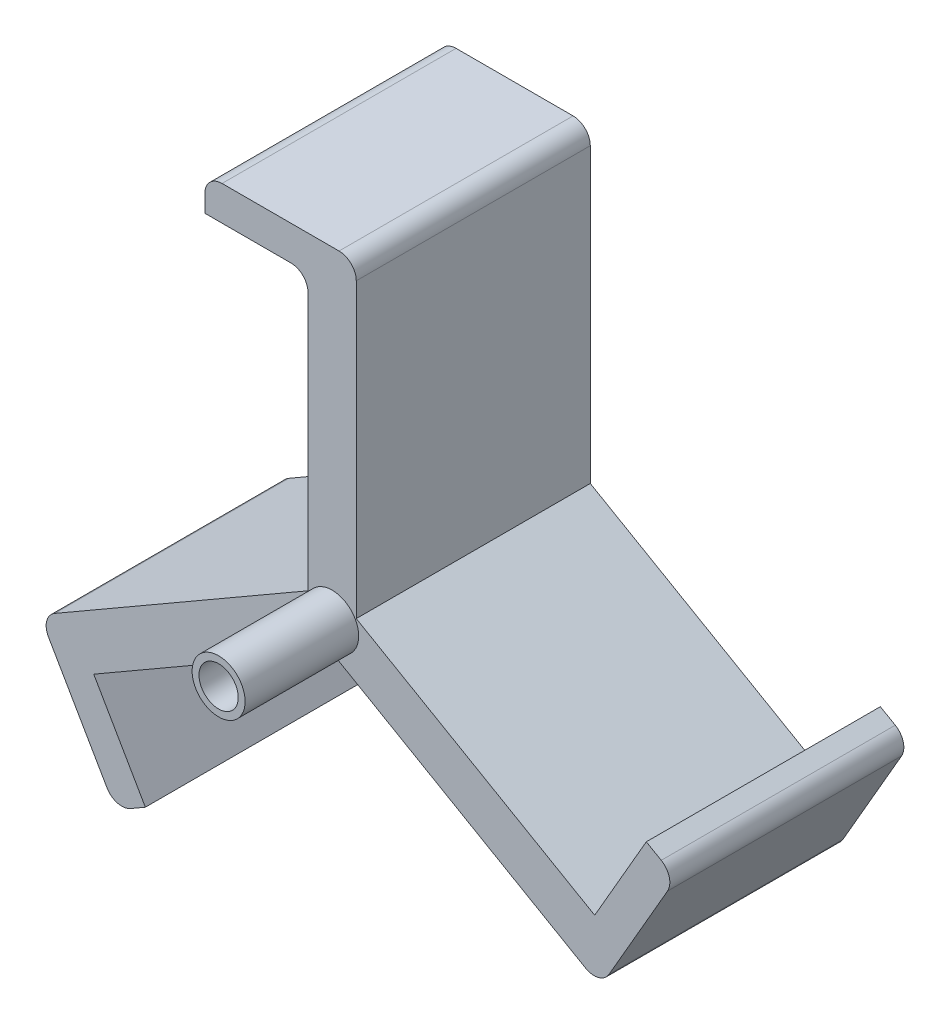
ISO-10303-21;
HEADER;
FILE_DESCRIPTION(('STEP AP214'),'2;1');
FILE_NAME('part.step','',(''),(''),'','','');
FILE_SCHEMA(('AUTOMOTIVE_DESIGN { 1 0 10303 214 1 1 1 1 }'));
ENDSEC;
DATA;
#1=APPLICATION_CONTEXT('core data for automotive mechanical design processes');
#2=APPLICATION_PROTOCOL_DEFINITION('international standard','automotive_design',2000,#1);
#3=PRODUCT_CONTEXT('',#1,'mechanical');
#4=PRODUCT('Part','Part','',(#3));
#5=PRODUCT_RELATED_PRODUCT_CATEGORY('part','',(#4));
#6=PRODUCT_DEFINITION_FORMATION('','',#4);
#7=PRODUCT_DEFINITION_CONTEXT('part definition',#1,'design');
#8=PRODUCT_DEFINITION('design','',#6,#7);
#9=PRODUCT_DEFINITION_SHAPE('','',#8);
#10=(LENGTH_UNIT() NAMED_UNIT(*) SI_UNIT(.MILLI.,.METRE.));
#11=(NAMED_UNIT(*) PLANE_ANGLE_UNIT() SI_UNIT($,.RADIAN.));
#12=(NAMED_UNIT(*) SI_UNIT($,.STERADIAN.) SOLID_ANGLE_UNIT());
#13=UNCERTAINTY_MEASURE_WITH_UNIT(LENGTH_MEASURE(1.E-05),#10,'distance_accuracy_value','');
#14=(GEOMETRIC_REPRESENTATION_CONTEXT(3) GLOBAL_UNCERTAINTY_ASSIGNED_CONTEXT((#13)) GLOBAL_UNIT_ASSIGNED_CONTEXT((#10,
#11,#12)) REPRESENTATION_CONTEXT('',''));
#15=CARTESIAN_POINT('',(0.,0.,0.));
#16=DIRECTION('',(0.,0.,1.));
#17=DIRECTION('',(1.,0.,0.));
#18=AXIS2_PLACEMENT_3D('',#15,#16,#17);
#19=CARTESIAN_POINT('',(0.591220249950698,-5.44190105340275,34.));
#20=DIRECTION('',(-0.499999999999986,-0.866025403784447,0.));
#21=DIRECTION('',(0.866025403784447,-0.499999999999986,0.));
#22=AXIS2_PLACEMENT_3D('',#19,#20,#21);
#23=PLANE('',#22);
#24=DIRECTION('',(0.,0.,1.));
#25=VECTOR('',#24,1.);
#26=CARTESIAN_POINT('',(35.2322364013286,-25.4419010534022,34.));
#27=LINE('',#26,#25);
#28=CARTESIAN_POINT('',(35.2322364013286,-25.4419010534022,0.));
#29=VERTEX_POINT('',#28);
#30=CARTESIAN_POINT('',(35.2322364013286,-25.4419010534022,34.));
#31=VERTEX_POINT('',#30);
#32=EDGE_CURVE('E204',#29,#31,#27,.T.);
#33=ORIENTED_EDGE('',*,*,#32,.F.);
#34=DIRECTION('',(-0.866025403784446,0.499999999999986,0.));
#35=VECTOR('',#34,1.);
#36=CARTESIAN_POINT('',(0.591220249950698,-5.44190105340275,0.));
#37=LINE('',#36,#35);
#38=CARTESIAN_POINT('',(0.591220249950698,-5.44190105340275,0.));
#39=VERTEX_POINT('',#38);
#40=EDGE_CURVE('E210',#29,#39,#37,.T.);
#41=ORIENTED_EDGE('',*,*,#40,.T.);
#42=DIRECTION('',(0.,0.,-1.));
#43=VECTOR('',#42,1.);
#44=CARTESIAN_POINT('',(0.591220249950698,-5.44190105340275,34.));
#45=LINE('',#44,#43);
#46=CARTESIAN_POINT('',(0.591220249950698,-5.44190105340275,34.));
#47=VERTEX_POINT('',#46);
#48=EDGE_CURVE('E325',#47,#39,#45,.T.);
#49=ORIENTED_EDGE('',*,*,#48,.F.);
#50=DIRECTION('',(-0.866025403784446,0.499999999999986,0.));
#51=VECTOR('',#50,1.);
#52=CARTESIAN_POINT('',(0.591220249950698,-5.44190105340275,34.));
#53=LINE('',#52,#51);
#54=EDGE_CURVE('E322',#31,#47,#53,.T.);
#55=ORIENTED_EDGE('',*,*,#54,.F.);
#56=EDGE_LOOP('',(#33,#41,#49,#55));
#57=FACE_BOUND('',#56,.T.);
#58=ADVANCED_FACE('F39',(#57),#23,.F.);
#59=CARTESIAN_POINT('',(-2.90877975004921,-11.5040788798939,34.));
#60=DIRECTION('',(-0.499999999999989,0.866025403784445,0.));
#61=DIRECTION('',(-0.866025403784445,-0.499999999999989,0.));
#62=AXIS2_PLACEMENT_3D('',#59,#60,#61);
#63=PLANE('',#62);
#64=DIRECTION('',(0.,0.,1.));
#65=VECTOR('',#64,1.);
#66=CARTESIAN_POINT('',(-37.549795901427,-31.5040788798934,0.));
#67=LINE('',#66,#65);
#68=CARTESIAN_POINT('',(-37.549795901427,-31.5040788798934,0.));
#69=VERTEX_POINT('',#68);
#70=CARTESIAN_POINT('',(-37.549795901427,-31.5040788798934,34.));
#71=VERTEX_POINT('',#70);
#72=EDGE_CURVE('E215',#69,#71,#67,.T.);
#73=ORIENTED_EDGE('',*,*,#72,.F.);
#74=DIRECTION('',(0.866025403784445,0.499999999999989,0.));
#75=VECTOR('',#74,1.);
#76=CARTESIAN_POINT('',(-2.90877975004921,-11.5040788798939,0.));
#77=LINE('',#76,#75);
#78=CARTESIAN_POINT('',(-2.90877975004921,-11.5040788798939,0.));
#79=VERTEX_POINT('',#78);
#80=EDGE_CURVE('E343',#69,#79,#77,.T.);
#81=ORIENTED_EDGE('',*,*,#80,.T.);
#82=DIRECTION('',(0.,0.,-1.));
#83=VECTOR('',#82,1.);
#84=CARTESIAN_POINT('',(-2.90877975004921,-11.5040788798939,34.));
#85=LINE('',#84,#83);
#86=CARTESIAN_POINT('',(-2.90877975004921,-11.5040788798939,34.));
#87=VERTEX_POINT('',#86);
#88=EDGE_CURVE('E358',#87,#79,#85,.T.);
#89=ORIENTED_EDGE('',*,*,#88,.F.);
#90=DIRECTION('',(0.866025403784445,0.499999999999989,0.));
#91=VECTOR('',#90,1.);
#92=CARTESIAN_POINT('',(-2.90877975004921,-11.5040788798939,34.));
#93=LINE('',#92,#91);
#94=EDGE_CURVE('E312',#71,#87,#93,.T.);
#95=ORIENTED_EDGE('',*,*,#94,.F.);
#96=EDGE_LOOP('',(#73,#81,#89,#95));
#97=FACE_BOUND('',#96,.T.);
#98=ADVANCED_FACE('F485',(#97),#63,.F.);
#99=CARTESIAN_POINT('',(-6.40877975004914,-5.44190105340275,34.));
#100=DIRECTION('',(1.,0.,0.));
#101=DIRECTION('',(0.,1.,0.));
#102=AXIS2_PLACEMENT_3D('',#99,#100,#101);
#103=PLANE('',#102);
#104=DIRECTION('',(0.,-1.,0.));
#105=VECTOR('',#104,1.);
#106=CARTESIAN_POINT('',(-6.40877975004914,-5.44190105340275,34.));
#107=LINE('',#106,#105);
#108=CARTESIAN_POINT('',(-6.40877975004914,32.0580989465972,34.));
#109=VERTEX_POINT('',#108);
#110=CARTESIAN_POINT('',(-6.40877975004914,-5.44190105340275,34.));
#111=VERTEX_POINT('',#110);
#112=EDGE_CURVE('E302',#109,#111,#107,.T.);
#113=ORIENTED_EDGE('',*,*,#112,.F.);
#114=DIRECTION('',(0.,0.,1.));
#115=VECTOR('',#114,1.);
#116=CARTESIAN_POINT('',(-6.40877975004914,32.0580989465972,0.));
#117=LINE('',#116,#115);
#118=CARTESIAN_POINT('',(-6.40877975004914,32.0580989465972,0.));
#119=VERTEX_POINT('',#118);
#120=EDGE_CURVE('E405',#109,#119,#117,.F.);
#121=ORIENTED_EDGE('',*,*,#120,.T.);
#122=DIRECTION('',(0.,-1.,0.));
#123=VECTOR('',#122,1.);
#124=CARTESIAN_POINT('',(-6.40877975004914,-5.44190105340275,0.));
#125=LINE('',#124,#123);
#126=CARTESIAN_POINT('',(-6.40877975004914,-5.44190105340275,0.));
#127=VERTEX_POINT('',#126);
#128=EDGE_CURVE('E332',#119,#127,#125,.T.);
#129=ORIENTED_EDGE('',*,*,#128,.T.);
#130=DIRECTION('',(0.,0.,-1.));
#131=VECTOR('',#130,1.);
#132=CARTESIAN_POINT('',(-6.40877975004914,-5.44190105340275,34.));
#133=LINE('',#132,#131);
#134=EDGE_CURVE('E362',#111,#127,#133,.T.);
#135=ORIENTED_EDGE('',*,*,#134,.F.);
#136=EDGE_LOOP('',(#113,#121,#129,#135));
#137=FACE_BOUND('',#136,.T.);
#138=ADVANCED_FACE('F532',(#137),#103,.F.);
#139=CARTESIAN_POINT('',(-2.90877975004922,-7.46262699556651,0.));
#140=DIRECTION('',(0.,0.,1.));
#141=DIRECTION('',(1.,0.,0.));
#142=AXIS2_PLACEMENT_3D('',#139,#140,#141);
#143=CYLINDRICAL_SURFACE('',#142,1.85);
#144=CARTESIAN_POINT('',(-2.90877975004922,-7.46262699556651,34.));
#145=DIRECTION('',(0.,0.,1.));
#146=DIRECTION('',(1.,0.,0.));
#147=AXIS2_PLACEMENT_3D('',#144,#145,#146);
#148=CIRCLE('',#147,1.85);
#149=CARTESIAN_POINT('',(-1.05877975004922,-7.46262699556651,34.));
#150=VERTEX_POINT('',#149);
#151=EDGE_CURVE('E278',#150,#150,#148,.T.);
#152=ORIENTED_EDGE('',*,*,#151,.T.);
#153=EDGE_LOOP('',(#152));
#154=FACE_BOUND('',#153,.T.);
#155=CARTESIAN_POINT('',(-2.90877975004922,-7.46262699556651,4.));
#156=DIRECTION('',(0.,0.,-1.));
#157=DIRECTION('',(-1.,0.,0.));
#158=AXIS2_PLACEMENT_3D('',#155,#156,#157);
#159=CIRCLE('',#158,1.85);
#160=CARTESIAN_POINT('',(-4.75877975004922,-7.46262699556651,4.));
#161=VERTEX_POINT('',#160);
#162=EDGE_CURVE('E274',#161,#161,#159,.F.);
#163=ORIENTED_EDGE('',*,*,#162,.F.);
#164=EDGE_LOOP('',(#163));
#165=FACE_BOUND('',#164,.T.);
#166=ADVANCED_FACE('F564',(#154,#165),#143,.F.);
#167=CARTESIAN_POINT('',(0.591220249950855,39.5580989465973,34.));
#168=DIRECTION('',(-1.,0.,0.));
#169=DIRECTION('',(0.,-1.,0.));
#170=AXIS2_PLACEMENT_3D('',#167,#168,#169);
#171=PLANE('',#170);
#172=DIRECTION('',(0.,1.,0.));
#173=VECTOR('',#172,1.);
#174=CARTESIAN_POINT('',(0.591220249950855,39.5580989465973,0.));
#175=LINE('',#174,#173);
#176=CARTESIAN_POINT('',(0.591220249950846,37.0580989465972,0.));
#177=VERTEX_POINT('',#176);
#178=EDGE_CURVE('E291',#39,#177,#175,.T.);
#179=ORIENTED_EDGE('',*,*,#178,.T.);
#180=DIRECTION('',(0.,0.,-1.));
#181=VECTOR('',#180,1.);
#182=CARTESIAN_POINT('',(0.591220249950846,37.0580989465972,34.));
#183=LINE('',#182,#181);
#184=CARTESIAN_POINT('',(0.591220249950846,37.0580989465972,34.));
#185=VERTEX_POINT('',#184);
#186=EDGE_CURVE('E395',#177,#185,#183,.F.);
#187=ORIENTED_EDGE('',*,*,#186,.T.);
#188=DIRECTION('',(0.,1.,0.));
#189=VECTOR('',#188,1.);
#190=CARTESIAN_POINT('',(0.591220249950855,39.5580989465973,34.));
#191=LINE('',#190,#189);
#192=EDGE_CURVE('E295',#47,#185,#191,.T.);
#193=ORIENTED_EDGE('',*,*,#192,.F.);
#194=ORIENTED_EDGE('',*,*,#48,.T.);
#195=EDGE_LOOP('',(#179,#187,#193,#194));
#196=FACE_BOUND('',#195,.T.);
#197=ADVANCED_FACE('F505',(#196),#171,.F.);
#198=CARTESIAN_POINT('',(-6.40877975004915,39.5580989465972,34.));
#199=DIRECTION('',(0.,-1.,0.));
#200=DIRECTION('',(1.,0.,0.));
#201=AXIS2_PLACEMENT_3D('',#198,#199,#200);
#202=PLANE('',#201);
#203=DIRECTION('',(-1.,0.,0.));
#204=VECTOR('',#203,1.);
#205=CARTESIAN_POINT('',(-6.40877975004915,39.5580989465972,34.));
#206=LINE('',#205,#204);
#207=CARTESIAN_POINT('',(-1.90877975004916,39.5580989465973,34.));
#208=VERTEX_POINT('',#207);
#209=CARTESIAN_POINT('',(-18.9087797500491,39.5580989465972,34.));
#210=VERTEX_POINT('',#209);
#211=EDGE_CURVE('E299',#208,#210,#206,.T.);
#212=ORIENTED_EDGE('',*,*,#211,.F.);
#213=DIRECTION('',(0.,0.,-1.));
#214=VECTOR('',#213,1.);
#215=CARTESIAN_POINT('',(-1.90877975004916,39.5580989465973,34.));
#216=LINE('',#215,#214);
#217=CARTESIAN_POINT('',(-1.90877975004916,39.5580989465973,0.));
#218=VERTEX_POINT('',#217);
#219=EDGE_CURVE('E388',#208,#218,#216,.T.);
#220=ORIENTED_EDGE('',*,*,#219,.T.);
#221=DIRECTION('',(-1.,0.,0.));
#222=VECTOR('',#221,1.);
#223=CARTESIAN_POINT('',(-6.40877975004915,39.5580989465972,0.));
#224=LINE('',#223,#222);
#225=CARTESIAN_POINT('',(-18.9087797500491,39.5580989465972,0.));
#226=VERTEX_POINT('',#225);
#227=EDGE_CURVE('E329',#218,#226,#224,.T.);
#228=ORIENTED_EDGE('',*,*,#227,.T.);
#229=DIRECTION('',(0.,0.,-1.));
#230=VECTOR('',#229,1.);
#231=CARTESIAN_POINT('',(-18.9087797500491,39.5580989465972,34.));
#232=LINE('',#231,#230);
#233=EDGE_CURVE('E381',#226,#210,#232,.F.);
#234=ORIENTED_EDGE('',*,*,#233,.T.);
#235=EDGE_LOOP('',(#212,#220,#228,#234));
#236=FACE_BOUND('',#235,.T.);
#237=ADVANCED_FACE('F512',(#236),#202,.F.);
#238=CARTESIAN_POINT('',(-45.3799229203491,-27.9419010534023,34.));
#239=DIRECTION('',(0.499999999999989,-0.866025403784445,0.));
#240=DIRECTION('',(0.866025403784445,0.499999999999989,0.));
#241=AXIS2_PLACEMENT_3D('',#238,#239,#240);
#242=PLANE('',#241);
#243=DIRECTION('',(-0.866025403784445,-0.499999999999989,0.));
#244=VECTOR('',#243,1.);
#245=CARTESIAN_POINT('',(-45.3799229203491,-27.9419010534023,0.));
#246=LINE('',#245,#244);
#247=CARTESIAN_POINT('',(-43.214859410888,-26.6919010534023,0.));
#248=VERTEX_POINT('',#247);
#249=EDGE_CURVE('E335',#127,#248,#246,.T.);
#250=ORIENTED_EDGE('',*,*,#249,.T.);
#251=DIRECTION('',(0.,0.,-1.));
#252=VECTOR('',#251,1.);
#253=CARTESIAN_POINT('',(-43.214859410888,-26.6919010534023,34.));
#254=LINE('',#253,#252);
#255=CARTESIAN_POINT('',(-43.214859410888,-26.6919010534023,34.));
#256=VERTEX_POINT('',#255);
#257=EDGE_CURVE('E48',#248,#256,#254,.F.);
#258=ORIENTED_EDGE('',*,*,#257,.T.);
#259=DIRECTION('',(-0.866025403784445,-0.499999999999989,0.));
#260=VECTOR('',#259,1.);
#261=CARTESIAN_POINT('',(-45.3799229203491,-27.9419010534023,34.));
#262=LINE('',#261,#260);
#263=EDGE_CURVE('E305',#111,#256,#262,.T.);
#264=ORIENTED_EDGE('',*,*,#263,.F.);
#265=ORIENTED_EDGE('',*,*,#134,.T.);
#266=EDGE_LOOP('',(#250,#258,#264,#265));
#267=FACE_BOUND('',#266,.T.);
#268=ADVANCED_FACE('F458',(#267),#242,.F.);
#269=CARTESIAN_POINT('',(-41.8799229203492,-34.0040788798934,34.));
#270=DIRECTION('',(0.866025403784445,0.499999999999988,0.));
#271=DIRECTION('',(-0.499999999999988,0.866025403784446,0.));
#272=AXIS2_PLACEMENT_3D('',#269,#270,#271);
#273=PLANE('',#272);
#274=DIRECTION('',(0.499999999999988,-0.866025403784446,0.));
#275=VECTOR('',#274,1.);
#276=CARTESIAN_POINT('',(-41.8799229203492,-34.0040788798934,34.));
#277=LINE('',#276,#275);
#278=CARTESIAN_POINT('',(-44.1299229203492,-30.1069645628634,34.));
#279=VERTEX_POINT('',#278);
#280=CARTESIAN_POINT('',(-35.6299229203494,-44.829396427199,34.));
#281=VERTEX_POINT('',#280);
#282=EDGE_CURVE('E309',#279,#281,#277,.T.);
#283=ORIENTED_EDGE('',*,*,#282,.F.);
#284=DIRECTION('',(0.,0.,-1.));
#285=VECTOR('',#284,1.);
#286=CARTESIAN_POINT('',(-44.1299229203492,-30.1069645628634,34.));
#287=LINE('',#286,#285);
#288=CARTESIAN_POINT('',(-44.1299229203492,-30.1069645628634,0.));
#289=VERTEX_POINT('',#288);
#290=EDGE_CURVE('E451',#279,#289,#287,.T.);
#291=ORIENTED_EDGE('',*,*,#290,.T.);
#292=DIRECTION('',(0.499999999999988,-0.866025403784446,0.));
#293=VECTOR('',#292,1.);
#294=CARTESIAN_POINT('',(-41.8799229203492,-34.0040788798934,0.));
#295=LINE('',#294,#293);
#296=CARTESIAN_POINT('',(-35.6299229203494,-44.829396427199,0.));
#297=VERTEX_POINT('',#296);
#298=EDGE_CURVE('E339',#289,#297,#295,.T.);
#299=ORIENTED_EDGE('',*,*,#298,.T.);
#300=DIRECTION('',(0.,0.,-1.));
#301=VECTOR('',#300,1.);
#302=CARTESIAN_POINT('',(-35.6299229203494,-44.829396427199,34.));
#303=LINE('',#302,#301);
#304=EDGE_CURVE('E448',#297,#281,#303,.F.);
#305=ORIENTED_EDGE('',*,*,#304,.T.);
#306=EDGE_LOOP('',(#283,#291,#299,#305));
#307=FACE_BOUND('',#306,.T.);
#308=ADVANCED_FACE('F470',(#307),#273,.F.);
#309=CARTESIAN_POINT('',(36.0623634202509,-34.0040788798933,34.));
#310=DIRECTION('',(0.499999999999987,0.866025403784447,0.));
#311=DIRECTION('',(-0.866025403784446,0.499999999999986,0.));
#312=AXIS2_PLACEMENT_3D('',#309,#310,#311);
#313=PLANE('',#312);
#314=DIRECTION('',(0.866025403784446,-0.499999999999986,0.));
#315=VECTOR('',#314,1.);
#316=CARTESIAN_POINT('',(36.0623634202509,-34.0040788798933,0.));
#317=LINE('',#316,#315);
#318=CARTESIAN_POINT('',(33.8972999107898,-32.7540788798933,0.));
#319=VERTEX_POINT('',#318);
#320=EDGE_CURVE('E346',#79,#319,#317,.T.);
#321=ORIENTED_EDGE('',*,*,#320,.T.);
#322=DIRECTION('',(0.,0.,-1.));
#323=VECTOR('',#322,1.);
#324=CARTESIAN_POINT('',(33.8972999107898,-32.7540788798933,34.));
#325=LINE('',#324,#323);
#326=CARTESIAN_POINT('',(33.8972999107898,-32.7540788798933,34.));
#327=VERTEX_POINT('',#326);
#328=EDGE_CURVE('E55',#319,#327,#325,.F.);
#329=ORIENTED_EDGE('',*,*,#328,.T.);
#330=DIRECTION('',(0.866025403784446,-0.499999999999986,0.));
#331=VECTOR('',#330,1.);
#332=CARTESIAN_POINT('',(36.0623634202509,-34.0040788798933,34.));
#333=LINE('',#332,#331);
#334=EDGE_CURVE('E315',#87,#327,#333,.T.);
#335=ORIENTED_EDGE('',*,*,#334,.F.);
#336=ORIENTED_EDGE('',*,*,#88,.T.);
#337=EDGE_LOOP('',(#321,#329,#335,#336));
#338=FACE_BOUND('',#337,.T.);
#339=ADVANCED_FACE('F487',(#338),#313,.F.);
#340=CARTESIAN_POINT('',(39.5623634202508,-27.9419010534021,34.));
#341=DIRECTION('',(-0.866025403784447,0.499999999999986,0.));
#342=DIRECTION('',(-0.499999999999986,-0.866025403784447,0.));
#343=AXIS2_PLACEMENT_3D('',#340,#341,#342);
#344=PLANE('',#343);
#345=DIRECTION('',(0.499999999999986,0.866025403784447,0.));
#346=VECTOR('',#345,1.);
#347=CARTESIAN_POINT('',(39.5623634202508,-27.9419010534021,0.));
#348=LINE('',#347,#346);
#349=CARTESIAN_POINT('',(37.3123634202508,-31.8390153704321,0.));
#350=VERTEX_POINT('',#349);
#351=CARTESIAN_POINT('',(45.8123634202506,-17.1165835060965,0.));
#352=VERTEX_POINT('',#351);
#353=EDGE_CURVE('E349',#350,#352,#348,.T.);
#354=ORIENTED_EDGE('',*,*,#353,.T.);
#355=DIRECTION('',(0.,0.,-1.));
#356=VECTOR('',#355,1.);
#357=CARTESIAN_POINT('',(45.8123634202506,-17.1165835060965,34.));
#358=LINE('',#357,#356);
#359=CARTESIAN_POINT('',(45.8123634202506,-17.1165835060965,34.));
#360=VERTEX_POINT('',#359);
#361=EDGE_CURVE('E432',#352,#360,#358,.F.);
#362=ORIENTED_EDGE('',*,*,#361,.T.);
#363=DIRECTION('',(0.499999999999986,0.866025403784447,0.));
#364=VECTOR('',#363,1.);
#365=CARTESIAN_POINT('',(39.5623634202508,-27.9419010534021,34.));
#366=LINE('',#365,#364);
#367=CARTESIAN_POINT('',(37.3123634202508,-31.8390153704321,34.));
#368=VERTEX_POINT('',#367);
#369=EDGE_CURVE('E318',#368,#360,#366,.T.);
#370=ORIENTED_EDGE('',*,*,#369,.F.);
#371=DIRECTION('',(0.,0.,-1.));
#372=VECTOR('',#371,1.);
#373=CARTESIAN_POINT('',(37.3123634202508,-31.8390153704321,34.));
#374=LINE('',#373,#372);
#375=EDGE_CURVE('E428',#368,#350,#374,.T.);
#376=ORIENTED_EDGE('',*,*,#375,.T.);
#377=EDGE_LOOP('',(#354,#362,#370,#376));
#378=FACE_BOUND('',#377,.T.);
#379=ADVANCED_FACE('F495',(#378),#344,.F.);
#380=CARTESIAN_POINT('',(0.,0.,34.));
#381=DIRECTION('',(0.,0.,1.));
#382=DIRECTION('',(1.,0.,0.));
#383=AXIS2_PLACEMENT_3D('',#380,#381,#382);
#384=PLANE('',#383);
#385=CARTESIAN_POINT('',(-2.90877975004922,-7.46262699556651,34.));
#386=DIRECTION('',(0.,0.,1.));
#387=DIRECTION('',(1.,0.,0.));
#388=AXIS2_PLACEMENT_3D('',#385,#386,#387);
#389=CIRCLE('',#388,3.85);
#390=CARTESIAN_POINT('',(0.941220249950777,-7.46262699556651,34.));
#391=VERTEX_POINT('',#390);
#392=EDGE_CURVE('E286',#391,#391,#389,.T.);
#393=ORIENTED_EDGE('',*,*,#392,.F.);
#394=EDGE_LOOP('',(#393));
#395=FACE_BOUND('',#394,.T.);
#396=ORIENTED_EDGE('',*,*,#369,.T.);
#397=CARTESIAN_POINT('',(43.6472999107895,-15.8665835060966,34.));
#398=DIRECTION('',(0.,0.,1.));
#399=DIRECTION('',(1.,0.,0.));
#400=AXIS2_PLACEMENT_3D('',#397,#398,#399);
#401=CIRCLE('',#400,2.5);
#402=CARTESIAN_POINT('',(44.8972999107895,-13.7015199966355,34.));
#403=VERTEX_POINT('',#402);
#404=EDGE_CURVE('E443',#360,#403,#401,.T.);
#405=ORIENTED_EDGE('',*,*,#404,.T.);
#406=DIRECTION('',(0.866025403784446,-0.499999999999986,0.));
#407=VECTOR('',#406,1.);
#408=CARTESIAN_POINT('',(47.0623634202506,-14.9515199966354,34.));
#409=LINE('',#408,#407);
#410=CARTESIAN_POINT('',(42.7322364013284,-12.4515199966355,34.));
#411=VERTEX_POINT('',#410);
#412=EDGE_CURVE('E222',#411,#403,#409,.T.);
#413=ORIENTED_EDGE('',*,*,#412,.F.);
#414=DIRECTION('',(-0.499999999999986,-0.866025403784447,0.));
#415=VECTOR('',#414,1.);
#416=CARTESIAN_POINT('',(42.7322364013284,-12.4515199966355,34.));
#417=LINE('',#416,#415);
#418=EDGE_CURVE('E216',#411,#31,#417,.T.);
#419=ORIENTED_EDGE('',*,*,#418,.T.);
#420=ORIENTED_EDGE('',*,*,#54,.T.);
#421=ORIENTED_EDGE('',*,*,#192,.T.);
#422=CARTESIAN_POINT('',(-1.90877975004915,37.0580989465972,34.));
#423=DIRECTION('',(0.,0.,1.));
#424=DIRECTION('',(1.,0.,0.));
#425=AXIS2_PLACEMENT_3D('',#422,#423,#424);
#426=CIRCLE('',#425,2.5);
#427=EDGE_CURVE('E398',#185,#208,#426,.T.);
#428=ORIENTED_EDGE('',*,*,#427,.T.);
#429=ORIENTED_EDGE('',*,*,#211,.T.);
#430=CARTESIAN_POINT('',(-18.9087797500491,37.0580989465972,34.));
#431=DIRECTION('',(0.,0.,1.));
#432=DIRECTION('',(1.,0.,0.));
#433=AXIS2_PLACEMENT_3D('',#430,#431,#432);
#434=CIRCLE('',#433,2.5);
#435=CARTESIAN_POINT('',(-21.4087797500491,37.0580989465972,34.));
#436=VERTEX_POINT('',#435);
#437=EDGE_CURVE('E385',#210,#436,#434,.T.);
#438=ORIENTED_EDGE('',*,*,#437,.T.);
#439=DIRECTION('',(0.,1.,0.));
#440=VECTOR('',#439,1.);
#441=CARTESIAN_POINT('',(-21.4087797500491,39.5580989465972,34.));
#442=LINE('',#441,#440);
#443=CARTESIAN_POINT('',(-21.4087797500491,34.5580989465972,34.));
#444=VERTEX_POINT('',#443);
#445=EDGE_CURVE('E257',#444,#436,#442,.T.);
#446=ORIENTED_EDGE('',*,*,#445,.F.);
#447=DIRECTION('',(1.,0.,0.));
#448=VECTOR('',#447,1.);
#449=CARTESIAN_POINT('',(-21.4087797500491,34.5580989465972,34.));
#450=LINE('',#449,#448);
#451=CARTESIAN_POINT('',(-8.90877975004915,34.5580989465972,34.));
#452=VERTEX_POINT('',#451);
#453=EDGE_CURVE('E261',#444,#452,#450,.T.);
#454=ORIENTED_EDGE('',*,*,#453,.T.);
#455=CARTESIAN_POINT('',(-8.90877975004915,32.0580989465972,34.));
#456=DIRECTION('',(0.,0.,1.));
#457=DIRECTION('',(1.,0.,0.));
#458=AXIS2_PLACEMENT_3D('',#455,#456,#457);
#459=CIRCLE('',#458,2.5);
#460=EDGE_CURVE('E408',#452,#109,#459,.F.);
#461=ORIENTED_EDGE('',*,*,#460,.T.);
#462=ORIENTED_EDGE('',*,*,#112,.T.);
#463=ORIENTED_EDGE('',*,*,#263,.T.);
#464=CARTESIAN_POINT('',(-41.9648594108881,-28.8569645628634,34.));
#465=DIRECTION('',(0.,0.,1.));
#466=DIRECTION('',(1.,0.,0.));
#467=AXIS2_PLACEMENT_3D('',#464,#465,#466);
#468=CIRCLE('',#467,2.5);
#469=EDGE_CURVE('E437',#256,#279,#468,.T.);
#470=ORIENTED_EDGE('',*,*,#469,.T.);
#471=ORIENTED_EDGE('',*,*,#282,.T.);
#472=CARTESIAN_POINT('',(-33.4648594108883,-43.579396427199,34.));
#473=DIRECTION('',(0.,0.,1.));
#474=DIRECTION('',(1.,0.,0.));
#475=AXIS2_PLACEMENT_3D('',#472,#473,#474);
#476=CIRCLE('',#475,2.5);
#477=CARTESIAN_POINT('',(-32.2148594108883,-45.7444599366601,34.));
#478=VERTEX_POINT('',#477);
#479=EDGE_CURVE('E63',#281,#478,#476,.T.);
#480=ORIENTED_EDGE('',*,*,#479,.T.);
#481=DIRECTION('',(-0.866025403784445,-0.49999999999999,0.));
#482=VECTOR('',#481,1.);
#483=CARTESIAN_POINT('',(-34.3799229203494,-46.9944599366601,34.));
#484=LINE('',#483,#482);
#485=CARTESIAN_POINT('',(-30.0497959014272,-44.4944599366601,34.));
#486=VERTEX_POINT('',#485);
#487=EDGE_CURVE('E237',#486,#478,#484,.T.);
#488=ORIENTED_EDGE('',*,*,#487,.F.);
#489=DIRECTION('',(-0.499999999999989,0.866025403784445,0.));
#490=VECTOR('',#489,1.);
#491=CARTESIAN_POINT('',(-30.0497959014272,-44.4944599366601,34.));
#492=LINE('',#491,#490);
#493=EDGE_CURVE('E240',#486,#71,#492,.T.);
#494=ORIENTED_EDGE('',*,*,#493,.T.);
#495=ORIENTED_EDGE('',*,*,#94,.T.);
#496=ORIENTED_EDGE('',*,*,#334,.T.);
#497=CARTESIAN_POINT('',(35.1472999107897,-30.5890153704322,34.));
#498=DIRECTION('',(0.,0.,1.));
#499=DIRECTION('',(1.,0.,0.));
#500=AXIS2_PLACEMENT_3D('',#497,#498,#499);
#501=CIRCLE('',#500,2.5);
#502=EDGE_CURVE('E440',#327,#368,#501,.T.);
#503=ORIENTED_EDGE('',*,*,#502,.T.);
#504=EDGE_LOOP('',(#396,#405,#413,#419,#420,#421,#428,#429,#438,#446,#454,#461,#462,#463,#470,
#471,#480,#488,#494,#495,#496,#503));
#505=FACE_BOUND('',#504,.T.);
#506=ADVANCED_FACE('F462',(#395,#505),#384,.T.);
#507=CARTESIAN_POINT('',(0.,0.,0.));
#508=DIRECTION('',(0.,0.,1.));
#509=DIRECTION('',(1.,0.,0.));
#510=AXIS2_PLACEMENT_3D('',#507,#508,#509);
#511=PLANE('',#510);
#512=CARTESIAN_POINT('',(-2.90877975004922,-7.46262699556651,0.));
#513=DIRECTION('',(0.,0.,-1.));
#514=DIRECTION('',(-1.,0.,0.));
#515=AXIS2_PLACEMENT_3D('',#512,#513,#514);
#516=CIRCLE('',#515,3.);
#517=CARTESIAN_POINT('',(-5.90877975004922,-7.46262699556651,0.));
#518=VERTEX_POINT('',#517);
#519=EDGE_CURVE('E269',#518,#518,#516,.T.);
#520=ORIENTED_EDGE('',*,*,#519,.F.);
#521=EDGE_LOOP('',(#520));
#522=FACE_BOUND('',#521,.T.);
#523=DIRECTION('',(-0.866025403784446,0.499999999999986,0.));
#524=VECTOR('',#523,1.);
#525=CARTESIAN_POINT('',(47.0623634202506,-14.9515199966354,0.));
#526=LINE('',#525,#524);
#527=CARTESIAN_POINT('',(44.8972999107895,-13.7015199966355,0.));
#528=VERTEX_POINT('',#527);
#529=CARTESIAN_POINT('',(42.7322364013284,-12.4515199966355,0.));
#530=VERTEX_POINT('',#529);
#531=EDGE_CURVE('E193',#528,#530,#526,.T.);
#532=ORIENTED_EDGE('',*,*,#531,.F.);
#533=CARTESIAN_POINT('',(43.6472999107895,-15.8665835060966,0.));
#534=DIRECTION('',(0.,0.,1.));
#535=DIRECTION('',(1.,0.,0.));
#536=AXIS2_PLACEMENT_3D('',#533,#534,#535);
#537=CIRCLE('',#536,2.5);
#538=EDGE_CURVE('E425',#528,#352,#537,.F.);
#539=ORIENTED_EDGE('',*,*,#538,.T.);
#540=ORIENTED_EDGE('',*,*,#353,.F.);
#541=CARTESIAN_POINT('',(35.1472999107897,-30.5890153704322,0.));
#542=DIRECTION('',(0.,0.,1.));
#543=DIRECTION('',(1.,0.,0.));
#544=AXIS2_PLACEMENT_3D('',#541,#542,#543);
#545=CIRCLE('',#544,2.5);
#546=EDGE_CURVE('E422',#350,#319,#545,.F.);
#547=ORIENTED_EDGE('',*,*,#546,.T.);
#548=ORIENTED_EDGE('',*,*,#320,.F.);
#549=ORIENTED_EDGE('',*,*,#80,.F.);
#550=DIRECTION('',(-0.499999999999989,0.866025403784445,0.));
#551=VECTOR('',#550,1.);
#552=CARTESIAN_POINT('',(-30.0497959014272,-44.4944599366601,0.));
#553=LINE('',#552,#551);
#554=CARTESIAN_POINT('',(-30.0497959014272,-44.4944599366601,0.));
#555=VERTEX_POINT('',#554);
#556=EDGE_CURVE('E247',#555,#69,#553,.T.);
#557=ORIENTED_EDGE('',*,*,#556,.F.);
#558=DIRECTION('',(0.866025403784445,0.49999999999999,0.));
#559=VECTOR('',#558,1.);
#560=CARTESIAN_POINT('',(-34.3799229203494,-46.9944599366601,0.));
#561=LINE('',#560,#559);
#562=CARTESIAN_POINT('',(-32.2148594108883,-45.7444599366601,0.));
#563=VERTEX_POINT('',#562);
#564=EDGE_CURVE('E231',#563,#555,#561,.T.);
#565=ORIENTED_EDGE('',*,*,#564,.F.);
#566=CARTESIAN_POINT('',(-33.4648594108883,-43.579396427199,0.));
#567=DIRECTION('',(0.,0.,1.));
#568=DIRECTION('',(1.,0.,0.));
#569=AXIS2_PLACEMENT_3D('',#566,#567,#568);
#570=CIRCLE('',#569,2.5);
#571=EDGE_CURVE('E416',#563,#297,#570,.F.);
#572=ORIENTED_EDGE('',*,*,#571,.T.);
#573=ORIENTED_EDGE('',*,*,#298,.F.);
#574=CARTESIAN_POINT('',(-41.9648594108881,-28.8569645628634,0.));
#575=DIRECTION('',(0.,0.,1.));
#576=DIRECTION('',(1.,0.,0.));
#577=AXIS2_PLACEMENT_3D('',#574,#575,#576);
#578=CIRCLE('',#577,2.5);
#579=EDGE_CURVE('E419',#289,#248,#578,.F.);
#580=ORIENTED_EDGE('',*,*,#579,.T.);
#581=ORIENTED_EDGE('',*,*,#249,.F.);
#582=ORIENTED_EDGE('',*,*,#128,.F.);
#583=CARTESIAN_POINT('',(-8.90877975004915,32.0580989465972,0.));
#584=DIRECTION('',(0.,0.,1.));
#585=DIRECTION('',(1.,0.,0.));
#586=AXIS2_PLACEMENT_3D('',#583,#584,#585);
#587=CIRCLE('',#586,2.5);
#588=CARTESIAN_POINT('',(-8.90877975004915,34.5580989465972,0.));
#589=VERTEX_POINT('',#588);
#590=EDGE_CURVE('E411',#119,#589,#587,.T.);
#591=ORIENTED_EDGE('',*,*,#590,.T.);
#592=DIRECTION('',(1.,0.,0.));
#593=VECTOR('',#592,1.);
#594=CARTESIAN_POINT('',(-21.4087797500491,34.5580989465972,0.));
#595=LINE('',#594,#593);
#596=CARTESIAN_POINT('',(-21.4087797500491,34.5580989465972,0.));
#597=VERTEX_POINT('',#596);
#598=EDGE_CURVE('E265',#597,#589,#595,.T.);
#599=ORIENTED_EDGE('',*,*,#598,.F.);
#600=DIRECTION('',(0.,-1.,0.));
#601=VECTOR('',#600,1.);
#602=CARTESIAN_POINT('',(-21.4087797500491,39.5580989465972,0.));
#603=LINE('',#602,#601);
#604=CARTESIAN_POINT('',(-21.4087797500491,37.0580989465972,0.));
#605=VERTEX_POINT('',#604);
#606=EDGE_CURVE('E251',#605,#597,#603,.T.);
#607=ORIENTED_EDGE('',*,*,#606,.F.);
#608=CARTESIAN_POINT('',(-18.9087797500491,37.0580989465972,0.));
#609=DIRECTION('',(0.,0.,1.));
#610=DIRECTION('',(1.,0.,0.));
#611=AXIS2_PLACEMENT_3D('',#608,#609,#610);
#612=CIRCLE('',#611,2.5);
#613=EDGE_CURVE('E377',#605,#226,#612,.F.);
#614=ORIENTED_EDGE('',*,*,#613,.T.);
#615=ORIENTED_EDGE('',*,*,#227,.F.);
#616=CARTESIAN_POINT('',(-1.90877975004915,37.0580989465972,0.));
#617=DIRECTION('',(0.,0.,1.));
#618=DIRECTION('',(1.,0.,0.));
#619=AXIS2_PLACEMENT_3D('',#616,#617,#618);
#620=CIRCLE('',#619,2.5);
#621=EDGE_CURVE('E392',#218,#177,#620,.F.);
#622=ORIENTED_EDGE('',*,*,#621,.T.);
#623=ORIENTED_EDGE('',*,*,#178,.F.);
#624=ORIENTED_EDGE('',*,*,#40,.F.);
#625=DIRECTION('',(-0.499999999999986,-0.866025403784447,0.));
#626=VECTOR('',#625,1.);
#627=CARTESIAN_POINT('',(42.7322364013284,-12.4515199966355,0.));
#628=LINE('',#627,#626);
#629=EDGE_CURVE('E207',#530,#29,#628,.T.);
#630=ORIENTED_EDGE('',*,*,#629,.F.);
#631=EDGE_LOOP('',(#532,#539,#540,#547,#548,#549,#557,#565,#572,#573,#580,#581,#582,#591,#599,
#607,#614,#615,#622,#623,#624,#630));
#632=FACE_BOUND('',#631,.T.);
#633=ADVANCED_FACE('F208',(#522,#632),#511,.F.);
#634=CARTESIAN_POINT('',(-2.90877975004922,-7.46262699556651,50.5));
#635=DIRECTION('',(0.,0.,1.));
#636=DIRECTION('',(1.,0.,0.));
#637=AXIS2_PLACEMENT_3D('',#634,#635,#636);
#638=PLANE('',#637);
#639=CARTESIAN_POINT('',(-2.90877975004922,-7.46262699556651,50.5));
#640=DIRECTION('',(0.,0.,1.));
#641=DIRECTION('',(1.,0.,0.));
#642=AXIS2_PLACEMENT_3D('',#639,#640,#641);
#643=CIRCLE('',#642,3.85);
#644=CARTESIAN_POINT('',(0.941220249950777,-7.46262699556651,50.5));
#645=VERTEX_POINT('',#644);
#646=EDGE_CURVE('E287',#645,#645,#643,.T.);
#647=ORIENTED_EDGE('',*,*,#646,.T.);
#648=EDGE_LOOP('',(#647));
#649=FACE_BOUND('',#648,.T.);
#650=CARTESIAN_POINT('',(-2.90877975004922,-7.46262699556651,50.5));
#651=DIRECTION('',(0.,0.,1.));
#652=DIRECTION('',(1.,0.,0.));
#653=AXIS2_PLACEMENT_3D('',#650,#651,#652);
#654=CIRCLE('',#653,2.85);
#655=CARTESIAN_POINT('',(-0.0587797500492234,-7.46262699556651,50.5));
#656=VERTEX_POINT('',#655);
#657=EDGE_CURVE('E282',#656,#656,#654,.T.);
#658=ORIENTED_EDGE('',*,*,#657,.F.);
#659=EDGE_LOOP('',(#658));
#660=FACE_BOUND('',#659,.T.);
#661=ADVANCED_FACE('F597',(#649,#660),#638,.T.);
#662=CARTESIAN_POINT('',(-2.90877975004922,-7.46262699556651,50.5));
#663=DIRECTION('',(0.,0.,-1.));
#664=DIRECTION('',(-1.,0.,0.));
#665=AXIS2_PLACEMENT_3D('',#662,#663,#664);
#666=CYLINDRICAL_SURFACE('',#665,3.85);
#667=ORIENTED_EDGE('',*,*,#646,.F.);
#668=EDGE_LOOP('',(#667));
#669=FACE_BOUND('',#668,.T.);
#670=ORIENTED_EDGE('',*,*,#392,.T.);
#671=EDGE_LOOP('',(#670));
#672=FACE_BOUND('',#671,.T.);
#673=ADVANCED_FACE('F595',(#669,#672),#666,.T.);
#674=CARTESIAN_POINT('',(-2.90877975004922,-7.46262699556651,50.5));
#675=DIRECTION('',(0.,0.,-1.));
#676=DIRECTION('',(-1.,0.,0.));
#677=AXIS2_PLACEMENT_3D('',#674,#675,#676);
#678=CYLINDRICAL_SURFACE('',#677,2.85);
#679=ORIENTED_EDGE('',*,*,#657,.T.);
#680=EDGE_LOOP('',(#679));
#681=FACE_BOUND('',#680,.T.);
#682=CARTESIAN_POINT('',(-2.90877975004922,-7.46262699556651,34.));
#683=DIRECTION('',(0.,0.,1.));
#684=DIRECTION('',(1.,0.,0.));
#685=AXIS2_PLACEMENT_3D('',#682,#683,#684);
#686=CIRCLE('',#685,2.85);
#687=CARTESIAN_POINT('',(-0.0587797500492234,-7.46262699556651,34.));
#688=VERTEX_POINT('',#687);
#689=EDGE_CURVE('E366',#688,#688,#686,.F.);
#690=ORIENTED_EDGE('',*,*,#689,.T.);
#691=EDGE_LOOP('',(#690));
#692=FACE_BOUND('',#691,.T.);
#693=ADVANCED_FACE('F592',(#681,#692),#678,.F.);
#694=ORIENTED_EDGE('',*,*,#151,.F.);
#695=EDGE_LOOP('',(#694));
#696=FACE_BOUND('',#695,.T.);
#697=ORIENTED_EDGE('',*,*,#689,.F.);
#698=EDGE_LOOP('',(#697));
#699=FACE_BOUND('',#698,.T.);
#700=ADVANCED_FACE('F584',(#696,#699),#384,.T.);
#701=CARTESIAN_POINT('',(-2.90877975004922,-7.46262699556651,4.));
#702=DIRECTION('',(0.,0.,-1.));
#703=DIRECTION('',(-1.,0.,0.));
#704=AXIS2_PLACEMENT_3D('',#701,#702,#703);
#705=PLANE('',#704);
#706=CARTESIAN_POINT('',(-2.90877975004922,-7.46262699556651,4.));
#707=DIRECTION('',(0.,0.,-1.));
#708=DIRECTION('',(-1.,0.,0.));
#709=AXIS2_PLACEMENT_3D('',#706,#707,#708);
#710=CIRCLE('',#709,3.);
#711=CARTESIAN_POINT('',(-5.90877975004922,-7.46262699556651,4.));
#712=VERTEX_POINT('',#711);
#713=EDGE_CURVE('E270',#712,#712,#710,.T.);
#714=ORIENTED_EDGE('',*,*,#713,.T.);
#715=EDGE_LOOP('',(#714));
#716=FACE_BOUND('',#715,.T.);
#717=ORIENTED_EDGE('',*,*,#162,.T.);
#718=EDGE_LOOP('',(#717));
#719=FACE_BOUND('',#718,.T.);
#720=ADVANCED_FACE('F581',(#716,#719),#705,.T.);
#721=CARTESIAN_POINT('',(-2.90877975004922,-7.46262699556651,4.));
#722=DIRECTION('',(0.,0.,-1.));
#723=DIRECTION('',(-1.,0.,0.));
#724=AXIS2_PLACEMENT_3D('',#721,#722,#723);
#725=CYLINDRICAL_SURFACE('',#724,3.);
#726=ORIENTED_EDGE('',*,*,#713,.F.);
#727=EDGE_LOOP('',(#726));
#728=FACE_BOUND('',#727,.T.);
#729=ORIENTED_EDGE('',*,*,#519,.T.);
#730=EDGE_LOOP('',(#729));
#731=FACE_BOUND('',#730,.T.);
#732=ADVANCED_FACE('F577',(#728,#731),#725,.F.);
#733=CARTESIAN_POINT('',(-21.4087797500491,34.5580989465972,0.));
#734=DIRECTION('',(0.,1.,0.));
#735=DIRECTION('',(-1.,0.,0.));
#736=AXIS2_PLACEMENT_3D('',#733,#734,#735);
#737=PLANE('',#736);
#738=ORIENTED_EDGE('',*,*,#598,.T.);
#739=DIRECTION('',(0.,0.,1.));
#740=VECTOR('',#739,1.);
#741=CARTESIAN_POINT('',(-8.90877975004915,34.5580989465972,34.));
#742=LINE('',#741,#740);
#743=EDGE_CURVE('E401',#589,#452,#742,.T.);
#744=ORIENTED_EDGE('',*,*,#743,.T.);
#745=ORIENTED_EDGE('',*,*,#453,.F.);
#746=DIRECTION('',(0.,0.,1.));
#747=VECTOR('',#746,1.);
#748=CARTESIAN_POINT('',(-21.4087797500491,34.5580989465972,0.));
#749=LINE('',#748,#747);
#750=EDGE_CURVE('E254',#597,#444,#749,.T.);
#751=ORIENTED_EDGE('',*,*,#750,.F.);
#752=EDGE_LOOP('',(#738,#744,#745,#751));
#753=FACE_BOUND('',#752,.T.);
#754=ADVANCED_FACE('F527',(#753),#737,.F.);
#755=CARTESIAN_POINT('',(-21.4087797500491,0.,0.));
#756=DIRECTION('',(-1.,0.,0.));
#757=DIRECTION('',(0.,-1.,0.));
#758=AXIS2_PLACEMENT_3D('',#755,#756,#757);
#759=PLANE('',#758);
#760=ORIENTED_EDGE('',*,*,#445,.T.);
#761=DIRECTION('',(0.,0.,-1.));
#762=VECTOR('',#761,1.);
#763=CARTESIAN_POINT('',(-21.4087797500491,37.0580989465972,0.));
#764=LINE('',#763,#762);
#765=EDGE_CURVE('E370',#436,#605,#764,.T.);
#766=ORIENTED_EDGE('',*,*,#765,.T.);
#767=ORIENTED_EDGE('',*,*,#606,.T.);
#768=ORIENTED_EDGE('',*,*,#750,.T.);
#769=EDGE_LOOP('',(#760,#766,#767,#768));
#770=FACE_BOUND('',#769,.T.);
#771=ADVANCED_FACE('F521',(#770),#759,.T.);
#772=CARTESIAN_POINT('',(-18.9087797500491,37.0580989465972,0.));
#773=DIRECTION('',(0.,0.,1.));
#774=DIRECTION('',(1.,0.,0.));
#775=AXIS2_PLACEMENT_3D('',#772,#773,#774);
#776=CYLINDRICAL_SURFACE('',#775,2.5);
#777=ORIENTED_EDGE('',*,*,#437,.F.);
#778=ORIENTED_EDGE('',*,*,#233,.F.);
#779=ORIENTED_EDGE('',*,*,#613,.F.);
#780=ORIENTED_EDGE('',*,*,#765,.F.);
#781=EDGE_LOOP('',(#777,#778,#779,#780));
#782=FACE_BOUND('',#781,.T.);
#783=ADVANCED_FACE('F518',(#782),#776,.T.);
#784=CARTESIAN_POINT('',(-1.90877975004915,37.0580989465972,34.));
#785=DIRECTION('',(0.,0.,-1.));
#786=DIRECTION('',(-1.,0.,0.));
#787=AXIS2_PLACEMENT_3D('',#784,#785,#786);
#788=CYLINDRICAL_SURFACE('',#787,2.5);
#789=ORIENTED_EDGE('',*,*,#427,.F.);
#790=ORIENTED_EDGE('',*,*,#186,.F.);
#791=ORIENTED_EDGE('',*,*,#621,.F.);
#792=ORIENTED_EDGE('',*,*,#219,.F.);
#793=EDGE_LOOP('',(#789,#790,#791,#792));
#794=FACE_BOUND('',#793,.T.);
#795=ADVANCED_FACE('F508',(#794),#788,.T.);
#796=CARTESIAN_POINT('',(-8.90877975004915,32.0580989465972,0.));
#797=DIRECTION('',(0.,0.,-1.));
#798=DIRECTION('',(-1.,0.,0.));
#799=AXIS2_PLACEMENT_3D('',#796,#797,#798);
#800=CYLINDRICAL_SURFACE('',#799,2.5);
#801=ORIENTED_EDGE('',*,*,#590,.F.);
#802=ORIENTED_EDGE('',*,*,#120,.F.);
#803=ORIENTED_EDGE('',*,*,#460,.F.);
#804=ORIENTED_EDGE('',*,*,#743,.F.);
#805=EDGE_LOOP('',(#801,#802,#803,#804));
#806=FACE_BOUND('',#805,.T.);
#807=ADVANCED_FACE('F535',(#806),#800,.F.);
#808=CARTESIAN_POINT('',(-30.0497959014272,-44.4944599366601,0.));
#809=DIRECTION('',(-0.866025403784445,-0.499999999999989,0.));
#810=DIRECTION('',(0.499999999999989,-0.866025403784445,0.));
#811=AXIS2_PLACEMENT_3D('',#808,#809,#810);
#812=PLANE('',#811);
#813=ORIENTED_EDGE('',*,*,#72,.T.);
#814=ORIENTED_EDGE('',*,*,#493,.F.);
#815=DIRECTION('',(0.,0.,1.));
#816=VECTOR('',#815,1.);
#817=CARTESIAN_POINT('',(-30.0497959014272,-44.4944599366601,0.));
#818=LINE('',#817,#816);
#819=EDGE_CURVE('E234',#555,#486,#818,.T.);
#820=ORIENTED_EDGE('',*,*,#819,.F.);
#821=ORIENTED_EDGE('',*,*,#556,.T.);
#822=EDGE_LOOP('',(#813,#814,#820,#821));
#823=FACE_BOUND('',#822,.T.);
#824=ADVANCED_FACE('F482',(#823),#812,.F.);
#825=CARTESIAN_POINT('',(11.7542173410515,-20.358901637909,0.));
#826=DIRECTION('',(-0.49999999999999,0.866025403784445,0.));
#827=DIRECTION('',(-0.866025403784445,-0.49999999999999,0.));
#828=AXIS2_PLACEMENT_3D('',#825,#826,#827);
#829=PLANE('',#828);
#830=ORIENTED_EDGE('',*,*,#487,.T.);
#831=DIRECTION('',(0.,0.,-1.));
#832=VECTOR('',#831,1.);
#833=CARTESIAN_POINT('',(-32.2148594108883,-45.7444599366601,0.));
#834=LINE('',#833,#832);
#835=EDGE_CURVE('E11',#478,#563,#834,.T.);
#836=ORIENTED_EDGE('',*,*,#835,.T.);
#837=ORIENTED_EDGE('',*,*,#564,.T.);
#838=ORIENTED_EDGE('',*,*,#819,.T.);
#839=EDGE_LOOP('',(#830,#836,#837,#838));
#840=FACE_BOUND('',#839,.T.);
#841=ADVANCED_FACE('F477',(#840),#829,.F.);
#842=CARTESIAN_POINT('',(42.7322364013284,-12.4515199966355,34.));
#843=DIRECTION('',(0.866025403784447,-0.499999999999986,0.));
#844=DIRECTION('',(0.499999999999986,0.866025403784447,0.));
#845=AXIS2_PLACEMENT_3D('',#842,#843,#844);
#846=PLANE('',#845);
#847=ORIENTED_EDGE('',*,*,#32,.T.);
#848=ORIENTED_EDGE('',*,*,#418,.F.);
#849=DIRECTION('',(0.,0.,1.));
#850=VECTOR('',#849,1.);
#851=CARTESIAN_POINT('',(42.7322364013284,-12.4515199966355,34.));
#852=LINE('',#851,#850);
#853=EDGE_CURVE('E198',#530,#411,#852,.T.);
#854=ORIENTED_EDGE('',*,*,#853,.F.);
#855=ORIENTED_EDGE('',*,*,#629,.T.);
#856=EDGE_LOOP('',(#847,#848,#854,#855));
#857=FACE_BOUND('',#856,.T.);
#858=ADVANCED_FACE('F218',(#857),#846,.F.);
#859=CARTESIAN_POINT('',(5.29139278392346,9.1649611445591,0.));
#860=DIRECTION('',(0.499999999999986,0.866025403784447,0.));
#861=DIRECTION('',(-0.866025403784446,0.499999999999986,0.));
#862=AXIS2_PLACEMENT_3D('',#859,#860,#861);
#863=PLANE('',#862);
#864=ORIENTED_EDGE('',*,*,#412,.T.);
#865=DIRECTION('',(0.,0.,-1.));
#866=VECTOR('',#865,1.);
#867=CARTESIAN_POINT('',(44.8972999107895,-13.7015199966355,0.));
#868=LINE('',#867,#866);
#869=EDGE_CURVE('E201',#403,#528,#868,.T.);
#870=ORIENTED_EDGE('',*,*,#869,.T.);
#871=ORIENTED_EDGE('',*,*,#531,.T.);
#872=ORIENTED_EDGE('',*,*,#853,.T.);
#873=EDGE_LOOP('',(#864,#870,#871,#872));
#874=FACE_BOUND('',#873,.T.);
#875=ADVANCED_FACE('F196',(#874),#863,.T.);
#876=CARTESIAN_POINT('',(43.6472999107895,-15.8665835060966,0.));
#877=DIRECTION('',(0.,0.,1.));
#878=DIRECTION('',(1.,0.,0.));
#879=AXIS2_PLACEMENT_3D('',#876,#877,#878);
#880=CYLINDRICAL_SURFACE('',#879,2.5);
#881=ORIENTED_EDGE('',*,*,#404,.F.);
#882=ORIENTED_EDGE('',*,*,#361,.F.);
#883=ORIENTED_EDGE('',*,*,#538,.F.);
#884=ORIENTED_EDGE('',*,*,#869,.F.);
#885=EDGE_LOOP('',(#881,#882,#883,#884));
#886=FACE_BOUND('',#885,.T.);
#887=ADVANCED_FACE('F499',(#886),#880,.T.);
#888=CARTESIAN_POINT('',(35.1472999107897,-30.5890153704322,34.));
#889=DIRECTION('',(0.,0.,-1.));
#890=DIRECTION('',(-1.,0.,0.));
#891=AXIS2_PLACEMENT_3D('',#888,#889,#890);
#892=CYLINDRICAL_SURFACE('',#891,2.5);
#893=ORIENTED_EDGE('',*,*,#502,.F.);
#894=ORIENTED_EDGE('',*,*,#328,.F.);
#895=ORIENTED_EDGE('',*,*,#546,.F.);
#896=ORIENTED_EDGE('',*,*,#375,.F.);
#897=EDGE_LOOP('',(#893,#894,#895,#896));
#898=FACE_BOUND('',#897,.T.);
#899=ADVANCED_FACE('F492',(#898),#892,.T.);
#900=CARTESIAN_POINT('',(-41.9648594108881,-28.8569645628634,34.));
#901=DIRECTION('',(0.,0.,-1.));
#902=DIRECTION('',(-1.,0.,0.));
#903=AXIS2_PLACEMENT_3D('',#900,#901,#902);
#904=CYLINDRICAL_SURFACE('',#903,2.5);
#905=ORIENTED_EDGE('',*,*,#469,.F.);
#906=ORIENTED_EDGE('',*,*,#257,.F.);
#907=ORIENTED_EDGE('',*,*,#579,.F.);
#908=ORIENTED_EDGE('',*,*,#290,.F.);
#909=EDGE_LOOP('',(#905,#906,#907,#908));
#910=FACE_BOUND('',#909,.T.);
#911=ADVANCED_FACE('F467',(#910),#904,.T.);
#912=CARTESIAN_POINT('',(-33.4648594108883,-43.579396427199,0.));
#913=DIRECTION('',(0.,0.,-1.));
#914=DIRECTION('',(-1.,0.,0.));
#915=AXIS2_PLACEMENT_3D('',#912,#913,#914);
#916=CYLINDRICAL_SURFACE('',#915,2.5);
#917=ORIENTED_EDGE('',*,*,#479,.F.);
#918=ORIENTED_EDGE('',*,*,#304,.F.);
#919=ORIENTED_EDGE('',*,*,#571,.F.);
#920=ORIENTED_EDGE('',*,*,#835,.F.);
#921=EDGE_LOOP('',(#917,#918,#919,#920));
#922=FACE_BOUND('',#921,.T.);
#923=ADVANCED_FACE('F41',(#922),#916,.T.);
#924=CLOSED_SHELL('',(#58,#98,#138,#166,#197,#237,#268,#308,#339,#379,#506,#633,#661,#673,#693,
#700,#720,#732,#754,#771,#783,#795,#807,#824,#841,#858,#875,#887,#899,#911,#923));
#925=MANIFOLD_SOLID_BREP('B2',#924);
#926=ADVANCED_BREP_SHAPE_REPRESENTATION('',(#18,#925),#14);
#927=SHAPE_DEFINITION_REPRESENTATION(#9,#926);
ENDSEC;
END-ISO-10303-21;
